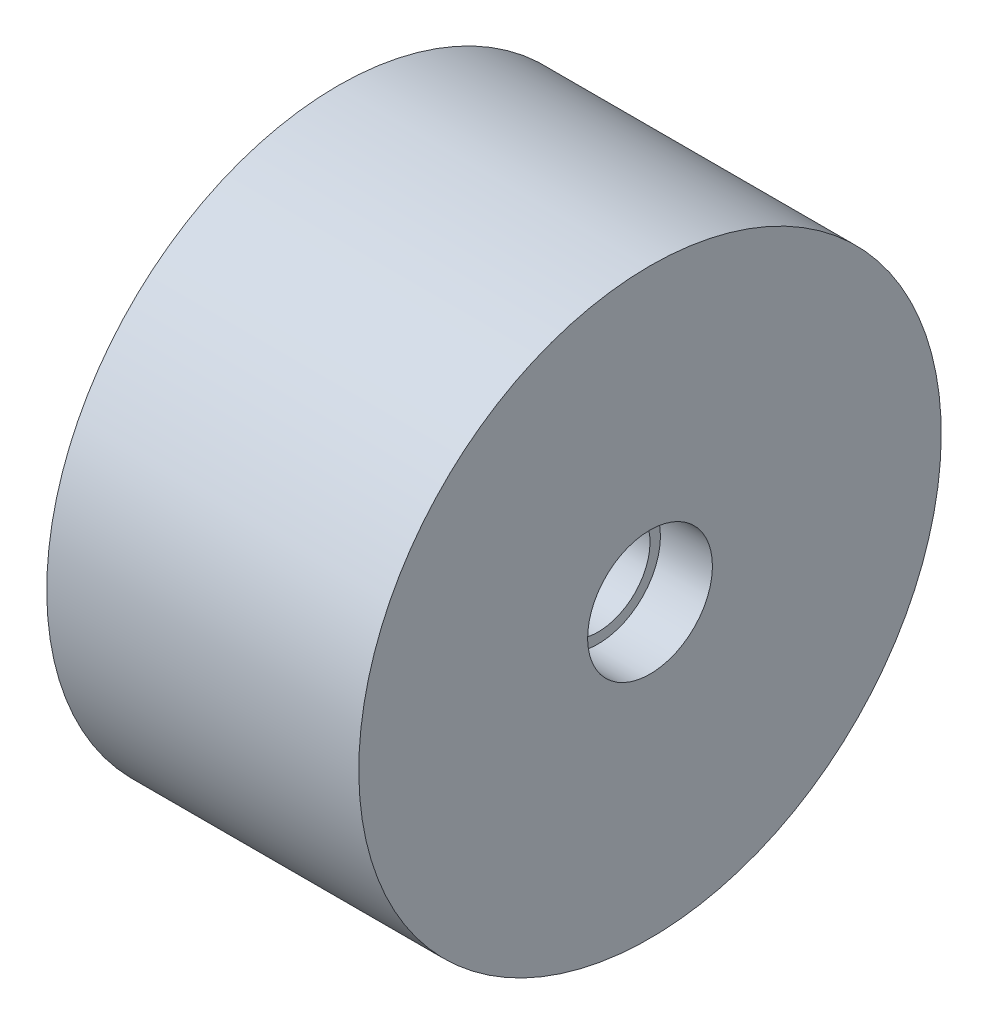
ISO-10303-21;
HEADER;
FILE_DESCRIPTION(('STEP AP214'),'2;1');
FILE_NAME('part.step','',(''),(''),'','','');
FILE_SCHEMA(('AUTOMOTIVE_DESIGN { 1 0 10303 214 1 1 1 1 }'));
ENDSEC;
DATA;
#1=APPLICATION_CONTEXT('core data for automotive mechanical design processes');
#2=APPLICATION_PROTOCOL_DEFINITION('international standard','automotive_design',2000,#1);
#3=PRODUCT_CONTEXT('',#1,'mechanical');
#4=PRODUCT('Part','Part','',(#3));
#5=PRODUCT_RELATED_PRODUCT_CATEGORY('part','',(#4));
#6=PRODUCT_DEFINITION_FORMATION('','',#4);
#7=PRODUCT_DEFINITION_CONTEXT('part definition',#1,'design');
#8=PRODUCT_DEFINITION('design','',#6,#7);
#9=PRODUCT_DEFINITION_SHAPE('','',#8);
#10=(LENGTH_UNIT() NAMED_UNIT(*) SI_UNIT(.MILLI.,.METRE.));
#11=(NAMED_UNIT(*) PLANE_ANGLE_UNIT() SI_UNIT($,.RADIAN.));
#12=(NAMED_UNIT(*) SI_UNIT($,.STERADIAN.) SOLID_ANGLE_UNIT());
#13=UNCERTAINTY_MEASURE_WITH_UNIT(LENGTH_MEASURE(1.E-05),#10,'distance_accuracy_value','');
#14=(GEOMETRIC_REPRESENTATION_CONTEXT(3) GLOBAL_UNCERTAINTY_ASSIGNED_CONTEXT((#13)) GLOBAL_UNIT_ASSIGNED_CONTEXT((#10,
#11,#12)) REPRESENTATION_CONTEXT('',''));
#15=CARTESIAN_POINT('',(0.,0.,0.));
#16=DIRECTION('',(0.,0.,1.));
#17=DIRECTION('',(1.,0.,0.));
#18=AXIS2_PLACEMENT_3D('',#15,#16,#17);
#19=CARTESIAN_POINT('',(0.922761861064179,14.,0.));
#20=DIRECTION('',(1.,0.,0.));
#21=DIRECTION('',(0.,1.,0.));
#22=AXIS2_PLACEMENT_3D('',#19,#20,#21);
#23=CYLINDRICAL_SURFACE('',#22,3.);
#24=CARTESIAN_POINT('',(-12.45,14.,0.));
#25=DIRECTION('',(1.,0.,0.));
#26=DIRECTION('',(0.,1.,0.));
#27=AXIS2_PLACEMENT_3D('',#24,#25,#26);
#28=CIRCLE('',#27,3.);
#29=CARTESIAN_POINT('',(-12.45,17.,0.));
#30=VERTEX_POINT('',#29);
#31=EDGE_CURVE('E10',#30,#30,#28,.T.);
#32=ORIENTED_EDGE('',*,*,#31,.T.);
#33=EDGE_LOOP('',(#32));
#34=FACE_BOUND('',#33,.T.);
#35=CARTESIAN_POINT('',(-14.,14.,0.));
#36=DIRECTION('',(1.,0.,0.));
#37=DIRECTION('',(0.,1.,0.));
#38=AXIS2_PLACEMENT_3D('',#35,#36,#37);
#39=CIRCLE('',#38,3.);
#40=CARTESIAN_POINT('',(-14.,17.,0.));
#41=VERTEX_POINT('',#40);
#42=EDGE_CURVE('E74',#41,#41,#39,.T.);
#43=ORIENTED_EDGE('',*,*,#42,.F.);
#44=EDGE_LOOP('',(#43));
#45=FACE_BOUND('',#44,.T.);
#46=ADVANCED_FACE('F34',(#34,#45),#23,.F.);
#47=CARTESIAN_POINT('',(-12.45,16.5,0.));
#48=DIRECTION('',(-1.,0.,0.));
#49=DIRECTION('',(0.,-1.,0.));
#50=AXIS2_PLACEMENT_3D('',#47,#48,#49);
#51=PLANE('',#50);
#52=CARTESIAN_POINT('',(-12.45,14.,0.));
#53=DIRECTION('',(1.,0.,0.));
#54=DIRECTION('',(0.,1.,0.));
#55=AXIS2_PLACEMENT_3D('',#52,#53,#54);
#56=CIRCLE('',#55,2.5);
#57=CARTESIAN_POINT('',(-12.45,16.5,0.));
#58=VERTEX_POINT('',#57);
#59=EDGE_CURVE('E40',#58,#58,#56,.T.);
#60=ORIENTED_EDGE('',*,*,#59,.T.);
#61=EDGE_LOOP('',(#60));
#62=FACE_BOUND('',#61,.T.);
#63=ORIENTED_EDGE('',*,*,#31,.F.);
#64=EDGE_LOOP('',(#63));
#65=FACE_BOUND('',#64,.T.);
#66=ADVANCED_FACE('F82',(#62,#65),#51,.T.);
#67=CARTESIAN_POINT('',(0.922761861064179,14.,0.));
#68=DIRECTION('',(1.,0.,0.));
#69=DIRECTION('',(0.,1.,0.));
#70=AXIS2_PLACEMENT_3D('',#67,#68,#69);
#71=CYLINDRICAL_SURFACE('',#70,2.5);
#72=CARTESIAN_POINT('',(-2.5,14.,0.));
#73=DIRECTION('',(1.,0.,0.));
#74=DIRECTION('',(0.,1.,0.));
#75=AXIS2_PLACEMENT_3D('',#72,#73,#74);
#76=CIRCLE('',#75,2.5);
#77=CARTESIAN_POINT('',(-2.5,16.5,0.));
#78=VERTEX_POINT('',#77);
#79=EDGE_CURVE('E44',#78,#78,#76,.T.);
#80=ORIENTED_EDGE('',*,*,#79,.T.);
#81=EDGE_LOOP('',(#80));
#82=FACE_BOUND('',#81,.T.);
#83=ORIENTED_EDGE('',*,*,#59,.F.);
#84=EDGE_LOOP('',(#83));
#85=FACE_BOUND('',#84,.T.);
#86=ADVANCED_FACE('F86',(#82,#85),#71,.F.);
#87=CARTESIAN_POINT('',(-2.5,17.,0.));
#88=DIRECTION('',(1.,0.,0.));
#89=DIRECTION('',(0.,1.,0.));
#90=AXIS2_PLACEMENT_3D('',#87,#88,#89);
#91=PLANE('',#90);
#92=CARTESIAN_POINT('',(-2.5,14.,0.));
#93=DIRECTION('',(1.,0.,0.));
#94=DIRECTION('',(0.,1.,0.));
#95=AXIS2_PLACEMENT_3D('',#92,#93,#94);
#96=CIRCLE('',#95,3.);
#97=CARTESIAN_POINT('',(-2.5,17.,0.));
#98=VERTEX_POINT('',#97);
#99=EDGE_CURVE('E48',#98,#98,#96,.T.);
#100=ORIENTED_EDGE('',*,*,#99,.T.);
#101=EDGE_LOOP('',(#100));
#102=FACE_BOUND('',#101,.T.);
#103=ORIENTED_EDGE('',*,*,#79,.F.);
#104=EDGE_LOOP('',(#103));
#105=FACE_BOUND('',#104,.T.);
#106=ADVANCED_FACE('F90',(#102,#105),#91,.T.);
#107=CARTESIAN_POINT('',(0.922761861064179,14.,0.));
#108=DIRECTION('',(1.,0.,0.));
#109=DIRECTION('',(0.,1.,0.));
#110=AXIS2_PLACEMENT_3D('',#107,#108,#109);
#111=CYLINDRICAL_SURFACE('',#110,3.);
#112=CARTESIAN_POINT('',(0.,14.,0.));
#113=DIRECTION('',(1.,0.,0.));
#114=DIRECTION('',(0.,1.,0.));
#115=AXIS2_PLACEMENT_3D('',#112,#113,#114);
#116=CIRCLE('',#115,3.);
#117=CARTESIAN_POINT('',(0.,17.,0.));
#118=VERTEX_POINT('',#117);
#119=EDGE_CURVE('E53',#118,#118,#116,.T.);
#120=ORIENTED_EDGE('',*,*,#119,.T.);
#121=EDGE_LOOP('',(#120));
#122=FACE_BOUND('',#121,.T.);
#123=ORIENTED_EDGE('',*,*,#99,.F.);
#124=EDGE_LOOP('',(#123));
#125=FACE_BOUND('',#124,.T.);
#126=ADVANCED_FACE('F97',(#122,#125),#111,.F.);
#127=CARTESIAN_POINT('',(0.,17.,0.));
#128=DIRECTION('',(1.,0.,0.));
#129=DIRECTION('',(0.,1.,0.));
#130=AXIS2_PLACEMENT_3D('',#127,#128,#129);
#131=PLANE('',#130);
#132=CARTESIAN_POINT('',(0.,14.,0.));
#133=DIRECTION('',(1.,0.,0.));
#134=DIRECTION('',(0.,1.,0.));
#135=AXIS2_PLACEMENT_3D('',#132,#133,#134);
#136=CIRCLE('',#135,14.);
#137=CARTESIAN_POINT('',(0.,28.,0.));
#138=VERTEX_POINT('',#137);
#139=EDGE_CURVE('E56',#138,#138,#136,.T.);
#140=ORIENTED_EDGE('',*,*,#139,.T.);
#141=EDGE_LOOP('',(#140));
#142=FACE_BOUND('',#141,.T.);
#143=ORIENTED_EDGE('',*,*,#119,.F.);
#144=EDGE_LOOP('',(#143));
#145=FACE_BOUND('',#144,.T.);
#146=ADVANCED_FACE('F101',(#142,#145),#131,.T.);
#147=CARTESIAN_POINT('',(0.922761861064179,14.,0.));
#148=DIRECTION('',(1.,0.,0.));
#149=DIRECTION('',(0.,1.,0.));
#150=AXIS2_PLACEMENT_3D('',#147,#148,#149);
#151=CYLINDRICAL_SURFACE('',#150,14.);
#152=CARTESIAN_POINT('',(-15.,14.,0.));
#153=DIRECTION('',(1.,0.,0.));
#154=DIRECTION('',(0.,1.,0.));
#155=AXIS2_PLACEMENT_3D('',#152,#153,#154);
#156=CIRCLE('',#155,14.);
#157=CARTESIAN_POINT('',(-15.,28.,0.));
#158=VERTEX_POINT('',#157);
#159=EDGE_CURVE('E59',#158,#158,#156,.T.);
#160=ORIENTED_EDGE('',*,*,#159,.T.);
#161=EDGE_LOOP('',(#160));
#162=FACE_BOUND('',#161,.T.);
#163=ORIENTED_EDGE('',*,*,#139,.F.);
#164=EDGE_LOOP('',(#163));
#165=FACE_BOUND('',#164,.T.);
#166=ADVANCED_FACE('F105',(#162,#165),#151,.T.);
#167=CARTESIAN_POINT('',(-15.,28.,0.));
#168=DIRECTION('',(-1.,0.,0.));
#169=DIRECTION('',(0.,-1.,0.));
#170=AXIS2_PLACEMENT_3D('',#167,#168,#169);
#171=PLANE('',#170);
#172=CARTESIAN_POINT('',(-15.,14.,0.));
#173=DIRECTION('',(1.,0.,0.));
#174=DIRECTION('',(0.,1.,0.));
#175=AXIS2_PLACEMENT_3D('',#172,#173,#174);
#176=CIRCLE('',#175,13.);
#177=CARTESIAN_POINT('',(-15.,27.,0.));
#178=VERTEX_POINT('',#177);
#179=EDGE_CURVE('E62',#178,#178,#176,.T.);
#180=ORIENTED_EDGE('',*,*,#179,.T.);
#181=EDGE_LOOP('',(#180));
#182=FACE_BOUND('',#181,.T.);
#183=ORIENTED_EDGE('',*,*,#159,.F.);
#184=EDGE_LOOP('',(#183));
#185=FACE_BOUND('',#184,.T.);
#186=ADVANCED_FACE('F109',(#182,#185),#171,.T.);
#187=CARTESIAN_POINT('',(0.922761861064179,14.,0.));
#188=DIRECTION('',(1.,0.,0.));
#189=DIRECTION('',(0.,1.,0.));
#190=AXIS2_PLACEMENT_3D('',#187,#188,#189);
#191=CYLINDRICAL_SURFACE('',#190,13.);
#192=CARTESIAN_POINT('',(-0.999999999999997,14.,0.));
#193=DIRECTION('',(1.,0.,0.));
#194=DIRECTION('',(0.,1.,0.));
#195=AXIS2_PLACEMENT_3D('',#192,#193,#194);
#196=CIRCLE('',#195,13.);
#197=CARTESIAN_POINT('',(-0.999999999999999,27.,0.));
#198=VERTEX_POINT('',#197);
#199=EDGE_CURVE('E65',#198,#198,#196,.T.);
#200=ORIENTED_EDGE('',*,*,#199,.T.);
#201=EDGE_LOOP('',(#200));
#202=FACE_BOUND('',#201,.T.);
#203=ORIENTED_EDGE('',*,*,#179,.F.);
#204=EDGE_LOOP('',(#203));
#205=FACE_BOUND('',#204,.T.);
#206=ADVANCED_FACE('F113',(#202,#205),#191,.F.);
#207=CARTESIAN_POINT('',(-0.999999999999999,27.,0.));
#208=DIRECTION('',(-1.,0.,0.));
#209=DIRECTION('',(0.,-1.,0.));
#210=AXIS2_PLACEMENT_3D('',#207,#208,#209);
#211=PLANE('',#210);
#212=CARTESIAN_POINT('',(-0.999999999999997,14.,0.));
#213=DIRECTION('',(1.,0.,0.));
#214=DIRECTION('',(0.,1.,0.));
#215=AXIS2_PLACEMENT_3D('',#212,#213,#214);
#216=CIRCLE('',#215,4.);
#217=CARTESIAN_POINT('',(-0.999999999999998,18.,0.));
#218=VERTEX_POINT('',#217);
#219=EDGE_CURVE('E68',#218,#218,#216,.T.);
#220=ORIENTED_EDGE('',*,*,#219,.T.);
#221=EDGE_LOOP('',(#220));
#222=FACE_BOUND('',#221,.T.);
#223=ORIENTED_EDGE('',*,*,#199,.F.);
#224=EDGE_LOOP('',(#223));
#225=FACE_BOUND('',#224,.T.);
#226=ADVANCED_FACE('F117',(#222,#225),#211,.T.);
#227=CARTESIAN_POINT('',(0.922761861064179,14.,0.));
#228=DIRECTION('',(1.,0.,0.));
#229=DIRECTION('',(0.,1.,0.));
#230=AXIS2_PLACEMENT_3D('',#227,#228,#229);
#231=CYLINDRICAL_SURFACE('',#230,4.);
#232=CARTESIAN_POINT('',(-14.,14.,0.));
#233=DIRECTION('',(1.,0.,0.));
#234=DIRECTION('',(0.,1.,0.));
#235=AXIS2_PLACEMENT_3D('',#232,#233,#234);
#236=CIRCLE('',#235,4.);
#237=CARTESIAN_POINT('',(-14.,18.,0.));
#238=VERTEX_POINT('',#237);
#239=EDGE_CURVE('E71',#238,#238,#236,.T.);
#240=ORIENTED_EDGE('',*,*,#239,.T.);
#241=EDGE_LOOP('',(#240));
#242=FACE_BOUND('',#241,.T.);
#243=ORIENTED_EDGE('',*,*,#219,.F.);
#244=EDGE_LOOP('',(#243));
#245=FACE_BOUND('',#244,.T.);
#246=ADVANCED_FACE('F121',(#242,#245),#231,.T.);
#247=CARTESIAN_POINT('',(-14.,18.,0.));
#248=DIRECTION('',(-1.,0.,0.));
#249=DIRECTION('',(0.,-1.,0.));
#250=AXIS2_PLACEMENT_3D('',#247,#248,#249);
#251=PLANE('',#250);
#252=ORIENTED_EDGE('',*,*,#42,.T.);
#253=EDGE_LOOP('',(#252));
#254=FACE_BOUND('',#253,.T.);
#255=ORIENTED_EDGE('',*,*,#239,.F.);
#256=EDGE_LOOP('',(#255));
#257=FACE_BOUND('',#256,.T.);
#258=ADVANCED_FACE('F78',(#254,#257),#251,.T.);
#259=CLOSED_SHELL('',(#46,#66,#86,#106,#126,#146,#166,#186,#206,#226,#246,#258));
#260=MANIFOLD_SOLID_BREP('B2',#259);
#261=ADVANCED_BREP_SHAPE_REPRESENTATION('',(#18,#260),#14);
#262=SHAPE_DEFINITION_REPRESENTATION(#9,#261);
ENDSEC;
END-ISO-10303-21;
